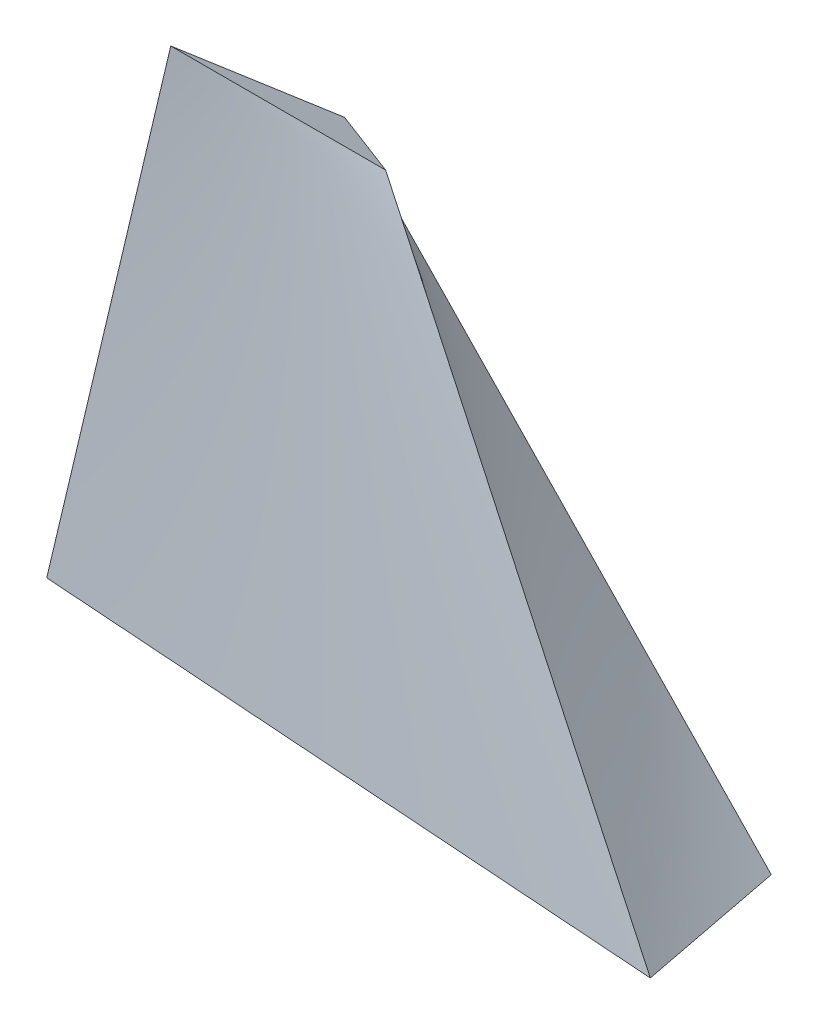
ISO-10303-21;
HEADER;
FILE_DESCRIPTION(('STEP AP214'),'2;1');
FILE_NAME('part.step','',(''),(''),'','','');
FILE_SCHEMA(('AUTOMOTIVE_DESIGN { 1 0 10303 214 1 1 1 1 }'));
ENDSEC;
DATA;
#1=APPLICATION_CONTEXT('core data for automotive mechanical design processes');
#2=APPLICATION_PROTOCOL_DEFINITION('international standard','automotive_design',2000,#1);
#3=PRODUCT_CONTEXT('',#1,'mechanical');
#4=PRODUCT('Part','Part','',(#3));
#5=PRODUCT_RELATED_PRODUCT_CATEGORY('part','',(#4));
#6=PRODUCT_DEFINITION_FORMATION('','',#4);
#7=PRODUCT_DEFINITION_CONTEXT('part definition',#1,'design');
#8=PRODUCT_DEFINITION('design','',#6,#7);
#9=PRODUCT_DEFINITION_SHAPE('','',#8);
#10=(LENGTH_UNIT() NAMED_UNIT(*) SI_UNIT(.MILLI.,.METRE.));
#11=(NAMED_UNIT(*) PLANE_ANGLE_UNIT() SI_UNIT($,.RADIAN.));
#12=(NAMED_UNIT(*) SI_UNIT($,.STERADIAN.) SOLID_ANGLE_UNIT());
#13=UNCERTAINTY_MEASURE_WITH_UNIT(LENGTH_MEASURE(1.E-05),#10,'distance_accuracy_value','');
#14=(GEOMETRIC_REPRESENTATION_CONTEXT(3) GLOBAL_UNCERTAINTY_ASSIGNED_CONTEXT((#13)) GLOBAL_UNIT_ASSIGNED_CONTEXT((#10,
#11,#12)) REPRESENTATION_CONTEXT('',''));
#15=CARTESIAN_POINT('',(0.,0.,0.));
#16=DIRECTION('',(0.,0.,1.));
#17=DIRECTION('',(1.,0.,0.));
#18=AXIS2_PLACEMENT_3D('',#15,#16,#17);
#19=CARTESIAN_POINT('',(0.,0.,0.));
#20=DIRECTION('',(0.,0.,1.));
#21=DIRECTION('',(1.,0.,0.));
#22=AXIS2_PLACEMENT_3D('',#19,#20,#21);
#23=PLANE('',#22);
#24=CARTESIAN_POINT('',(50.2624939835844,5.28695458593054,0.));
#25=CARTESIAN_POINT('',(38.1505616594526,17.8474769961413,0.));
#26=CARTESIAN_POINT('',(26.0386293353209,30.407999406352,0.));
#27=CARTESIAN_POINT('',(13.9266970111891,42.9685218165628,0.));
#28=B_SPLINE_CURVE_WITH_KNOTS('',3,(#24,#25,#26,#27),.UNSPECIFIED.,.F.,.F.,(4,4),(0.,1.),.UNSPECIFIED.);
#29=CARTESIAN_POINT('',(50.2624939835844,5.28695458593054,0.));
#30=VERTEX_POINT('',#29);
#31=CARTESIAN_POINT('',(13.9266970111891,42.9685218165628,0.));
#32=VERTEX_POINT('',#31);
#33=EDGE_CURVE('E156',#30,#32,#28,.T.);
#34=ORIENTED_EDGE('',*,*,#33,.F.);
#35=CARTESIAN_POINT('',(50.2624939835844,5.28695458593054,0.));
#36=CARTESIAN_POINT('',(33.5083293223896,3.52463639062036,0.));
#37=CARTESIAN_POINT('',(16.7541646611948,1.76231819531018,0.));
#38=CARTESIAN_POINT('',(0.,0.,0.));
#39=B_SPLINE_CURVE_WITH_KNOTS('',3,(#35,#36,#37,#38),.UNSPECIFIED.,.F.,.F.,(4,4),(0.,1.),.UNSPECIFIED.);
#40=CARTESIAN_POINT('',(0.,0.,0.));
#41=VERTEX_POINT('',#40);
#42=EDGE_CURVE('E184',#41,#30,#39,.F.);
#43=ORIENTED_EDGE('',*,*,#42,.F.);
#44=CARTESIAN_POINT('',(13.9266970111891,42.9685218165628,0.));
#45=CARTESIAN_POINT('',(9.28446467412604,28.6456812110418,0.));
#46=CARTESIAN_POINT('',(4.64223233706302,14.3228406055209,0.));
#47=CARTESIAN_POINT('',(0.,0.,0.));
#48=B_SPLINE_CURVE_WITH_KNOTS('',3,(#44,#45,#46,#47),.UNSPECIFIED.,.F.,.F.,(4,4),(0.,1.),.UNSPECIFIED.);
#49=EDGE_CURVE('E179',#41,#32,#48,.F.);
#50=ORIENTED_EDGE('',*,*,#49,.T.);
#51=EDGE_LOOP('',(#34,#43,#50));
#52=FACE_BOUND('',#51,.T.);
#53=ADVANCED_FACE('F125',(#52),#23,.F.);
#54=CARTESIAN_POINT('',(50.2624939835844,5.28695458593054,0.));
#55=CARTESIAN_POINT('',(51.0869709980779,5.28695458593054,4.25751721394363));
#56=CARTESIAN_POINT('',(51.9114480125714,5.28695458593054,8.51503442788725));
#57=CARTESIAN_POINT('',(52.7359250270649,5.28695458593054,12.7725516418309));
#58=CARTESIAN_POINT('',(38.1505616594526,17.8474769961413,0.));
#59=CARTESIAN_POINT('',(39.5537853503355,18.0743276356,3.30317043218727));
#60=CARTESIAN_POINT('',(40.9570090412184,18.3011782750587,6.60634086437454));
#61=CARTESIAN_POINT('',(42.3602327321013,18.5280289145174,9.90951129656181));
#62=CARTESIAN_POINT('',(26.0386293353209,30.407999406352,0.));
#63=CARTESIAN_POINT('',(28.0205997025931,30.8617006852695,2.34882365043091));
#64=CARTESIAN_POINT('',(30.0025700698654,31.3154019641869,4.69764730086183));
#65=CARTESIAN_POINT('',(31.9845404371377,31.7691032431043,7.04647095129274));
#66=CARTESIAN_POINT('',(13.9266970111891,42.9685218165628,0.));
#67=CARTESIAN_POINT('',(16.4874140548507,43.6490737349389,1.39447686867456));
#68=CARTESIAN_POINT('',(19.0481310985124,44.3296256533151,2.78895373734911));
#69=CARTESIAN_POINT('',(21.608848142174,45.0101775716912,4.18343060602367));
#70=B_SPLINE_SURFACE_WITH_KNOTS('',3,3,((#54,#55,#56,#57),(#58,#59,#60,#61),(#62,#63,#64,#65),
(#66,#67,#68,#69)),.UNSPECIFIED.,.F.,.F.,.F.,(4,4),(4,4),(0.,1.),(0.,1.),.UNSPECIFIED.);
#71=DIRECTION('',(-0.855237480442304,-0.227293175332603,-0.465732395796043));
#72=VECTOR('',#71,1.);
#73=CARTESIAN_POINT('',(21.608848142174,45.0101775716912,4.18343060602367));
#74=LINE('',#73,#72);
#75=CARTESIAN_POINT('',(21.608848142174,45.0101775716912,4.18343060602367));
#76=VERTEX_POINT('',#75);
#77=EDGE_CURVE('E159',#76,#32,#74,.T.);
#78=CARTESIAN_POINT('',(52.7359250270649,5.28695458593054,12.7725516418309));
#79=CARTESIAN_POINT('',(42.3602327321013,18.5280289145174,9.90951129656181));
#80=CARTESIAN_POINT('',(31.9845404371377,31.7691032431043,7.04647095129274));
#81=CARTESIAN_POINT('',(21.608848142174,45.0101775716912,4.18343060602367));
#82=B_SPLINE_CURVE_WITH_KNOTS('',3,(#78,#79,#80,#81),.UNSPECIFIED.,.F.,.F.,(4,4),(0.,1.),.UNSPECIFIED.);
#83=CARTESIAN_POINT('',(52.7359250270649,5.28695458593054,12.7725516418309));
#84=VERTEX_POINT('',#83);
#85=EDGE_CURVE('E143',#76,#84,#82,.F.);
#86=CARTESIAN_POINT('',(52.7359250270649,5.28695458593054,12.7725516418309));
#87=CARTESIAN_POINT('',(51.9114480125714,5.28695458593054,8.51503442788726));
#88=CARTESIAN_POINT('',(51.0869709980779,5.28695458593054,4.25751721394363));
#89=CARTESIAN_POINT('',(50.2624939835844,5.28695458593054,0.));
#90=B_SPLINE_CURVE_WITH_KNOTS('',3,(#86,#87,#88,#89),.UNSPECIFIED.,.F.,.F.,(4,4),(0.,1.),.UNSPECIFIED.);
#91=EDGE_CURVE('E162',#30,#84,#90,.F.);
#92=ORIENTED_EDGE('',*,*,#33,.T.);
#93=ORIENTED_EDGE('',*,*,#77,.F.);
#94=ORIENTED_EDGE('',*,*,#85,.T.);
#95=ORIENTED_EDGE('',*,*,#91,.F.);
#96=EDGE_LOOP('',(#92,#93,#94,#95));
#97=FACE_BOUND('',#96,.T.);
#98=ADVANCED_FACE('F158',(#97),#70,.T.);
#99=CARTESIAN_POINT('',(0.,34.7030516548671,-16.9362639910073));
#100=DIRECTION('',(0.,0.898687345867324,-0.438589847554574));
#101=DIRECTION('',(0.,0.438589847554574,0.898687345867324));
#102=AXIS2_PLACEMENT_3D('',#99,#100,#101);
#103=PLANE('',#102);
#104=CARTESIAN_POINT('',(3.31303219358496,45.0101775716912,4.18343060602367));
#105=CARTESIAN_POINT('',(6.85092046611966,44.329625653315,2.78895373734911));
#106=CARTESIAN_POINT('',(10.3888087386544,43.6490737349389,1.39447686867456));
#107=CARTESIAN_POINT('',(13.9266970111891,42.9685218165628,0.));
#108=B_SPLINE_CURVE_WITH_KNOTS('',3,(#104,#105,#106,#107),.UNSPECIFIED.,.F.,.F.,(4,4),(0.,1.),.UNSPECIFIED.);
#109=CARTESIAN_POINT('',(3.31303219358496,45.0101775716912,4.18343060602367));
#110=VERTEX_POINT('',#109);
#111=EDGE_CURVE('E172',#32,#110,#108,.F.);
#112=ORIENTED_EDGE('',*,*,#111,.T.);
#113=CARTESIAN_POINT('',(21.608848142174,45.0101775716912,4.18343060602367));
#114=CARTESIAN_POINT('',(15.5102428259777,45.0101775716912,4.18343060602367));
#115=CARTESIAN_POINT('',(9.41163750978132,45.0101775716912,4.18343060602367));
#116=CARTESIAN_POINT('',(3.31303219358496,45.0101775716912,4.18343060602367));
#117=B_SPLINE_CURVE_WITH_KNOTS('',3,(#113,#114,#115,#116),.UNSPECIFIED.,.F.,.F.,(4,4),(0.,1.),.UNSPECIFIED.);
#118=EDGE_CURVE('E174',#110,#76,#117,.F.);
#119=ORIENTED_EDGE('',*,*,#118,.T.);
#120=ORIENTED_EDGE('',*,*,#77,.T.);
#121=EDGE_LOOP('',(#112,#119,#120));
#122=FACE_BOUND('',#121,.T.);
#123=ADVANCED_FACE('F171',(#122),#103,.T.);
#124=CARTESIAN_POINT('',(3.31303219358496,45.0101775716912,4.18343060602367));
#125=CARTESIAN_POINT('',(6.85092046611966,44.329625653315,2.78895373734911));
#126=CARTESIAN_POINT('',(10.3888087386544,43.6490737349389,1.39447686867456));
#127=CARTESIAN_POINT('',(13.9266970111891,42.9685218165628,0.));
#128=CARTESIAN_POINT('',(-0.376773512935438,30.0067850477941,4.01397919598709));
#129=CARTESIAN_POINT('',(2.84363921608506,29.5530837688767,2.67598613065806));
#130=CARTESIAN_POINT('',(6.06405194510555,29.0993824899593,1.33799306532903));
#131=CARTESIAN_POINT('',(9.28446467412604,28.6456812110418,0.));
#132=CARTESIAN_POINT('',(-4.06657921945583,15.0033925238971,3.8445277859505));
#133=CARTESIAN_POINT('',(-1.16364203394955,14.7765418844383,2.563018523967));
#134=CARTESIAN_POINT('',(1.73929515155673,14.5496912449796,1.2815092619835));
#135=CARTESIAN_POINT('',(4.64223233706302,14.3228406055209,0.));
#136=CARTESIAN_POINT('',(-7.75638492597622,0.,3.67507637591392));
#137=CARTESIAN_POINT('',(-5.17092328398415,0.,2.45005091727595));
#138=CARTESIAN_POINT('',(-2.58546164199208,0.,1.22502545863797));
#139=CARTESIAN_POINT('',(0.,0.,0.));
#140=B_SPLINE_SURFACE_WITH_KNOTS('',3,3,((#124,#125,#126,#127),(#128,#129,#130,#131),(#132,#133,
#134,#135),(#136,#137,#138,#139)),.UNSPECIFIED.,.F.,.F.,.F.,(4,4),(4,4),(0.,1.),(0.,1.),.UNSPECIFIED.);
#141=CARTESIAN_POINT('',(-7.75638492597622,0.,3.67507637591392));
#142=CARTESIAN_POINT('',(-4.06657921945583,15.0033925238971,3.8445277859505));
#143=CARTESIAN_POINT('',(-0.376773512935437,30.0067850477941,4.01397919598709));
#144=CARTESIAN_POINT('',(3.31303219358496,45.0101775716912,4.18343060602367));
#145=B_SPLINE_CURVE_WITH_KNOTS('',3,(#141,#142,#143,#144),.UNSPECIFIED.,.F.,.F.,(4,4),(0.,1.),.UNSPECIFIED.);
#146=CARTESIAN_POINT('',(-7.75638492597622,0.,3.67507637591392));
#147=VERTEX_POINT('',#146);
#148=EDGE_CURVE('E134',#147,#110,#145,.T.);
#149=DIRECTION('',(0.903692790230263,0.,-0.428181434541295));
#150=VECTOR('',#149,1.);
#151=CARTESIAN_POINT('',(-3.87819246298811,0.,1.83753818795696));
#152=LINE('',#151,#150);
#153=EDGE_CURVE('E201',#147,#41,#152,.T.);
#154=ORIENTED_EDGE('',*,*,#148,.T.);
#155=ORIENTED_EDGE('',*,*,#111,.F.);
#156=ORIENTED_EDGE('',*,*,#49,.F.);
#157=ORIENTED_EDGE('',*,*,#153,.F.);
#158=EDGE_LOOP('',(#154,#155,#156,#157));
#159=FACE_BOUND('',#158,.T.);
#160=ADVANCED_FACE('F177',(#159),#140,.F.);
#161=CARTESIAN_POINT('',(52.7359250270649,5.28695458593054,12.7725516418309));
#162=CARTESIAN_POINT('',(51.9114480125714,5.28695458593054,8.51503442788726));
#163=CARTESIAN_POINT('',(51.0869709980779,5.28695458593054,4.25751721394363));
#164=CARTESIAN_POINT('',(50.2624939835844,5.28695458593054,0.));
#165=CARTESIAN_POINT('',(32.5718217093845,3.52463639062036,9.74005988652523));
#166=CARTESIAN_POINT('',(32.8839909137196,3.52463639062036,6.49337325768349));
#167=CARTESIAN_POINT('',(33.1961601180546,3.52463639062036,3.24668662884174));
#168=CARTESIAN_POINT('',(33.5083293223896,3.52463639062036,0.));
#169=CARTESIAN_POINT('',(12.4077183917042,1.76231819531018,6.70756813121957));
#170=CARTESIAN_POINT('',(13.8565338148677,1.76231819531018,4.47171208747972));
#171=CARTESIAN_POINT('',(15.3053492380313,1.76231819531018,2.23585604373986));
#172=CARTESIAN_POINT('',(16.7541646611948,1.76231819531018,0.));
#173=CARTESIAN_POINT('',(-7.75638492597622,0.,3.67507637591392));
#174=CARTESIAN_POINT('',(-5.17092328398415,0.,2.45005091727595));
#175=CARTESIAN_POINT('',(-2.58546164199207,0.,1.22502545863797));
#176=CARTESIAN_POINT('',(0.,0.,0.));
#177=B_SPLINE_SURFACE_WITH_KNOTS('',3,3,((#161,#162,#163,#164),(#165,#166,#167,#168),(#169,#170,
#171,#172),(#173,#174,#175,#176)),.UNSPECIFIED.,.F.,.F.,.F.,(4,4),(4,4),(0.,1.),(0.,1.),.UNSPECIFIED.);
#178=CARTESIAN_POINT('',(52.7359250270649,5.28695458593054,12.7725516418309));
#179=CARTESIAN_POINT('',(32.5718217093845,3.52463639062036,9.74005988652523));
#180=CARTESIAN_POINT('',(12.4077183917042,1.76231819531018,6.70756813121957));
#181=CARTESIAN_POINT('',(-7.75638492597622,0.,3.67507637591392));
#182=B_SPLINE_CURVE_WITH_KNOTS('',3,(#178,#179,#180,#181),.UNSPECIFIED.,.F.,.F.,(4,4),(0.,1.),.UNSPECIFIED.);
#183=EDGE_CURVE('E13',#84,#147,#182,.T.);
#184=ORIENTED_EDGE('',*,*,#183,.T.);
#185=ORIENTED_EDGE('',*,*,#153,.T.);
#186=ORIENTED_EDGE('',*,*,#42,.T.);
#187=ORIENTED_EDGE('',*,*,#91,.T.);
#188=EDGE_LOOP('',(#184,#185,#186,#187));
#189=FACE_BOUND('',#188,.T.);
#190=ADVANCED_FACE('F264',(#189),#177,.T.);
#191=CARTESIAN_POINT('',(52.7359250270649,5.28695458593054,12.7725516418309));
#192=CARTESIAN_POINT('',(42.3602327321013,18.5280289145174,9.90951129656181));
#193=CARTESIAN_POINT('',(31.9845404371377,31.7691032431043,7.04647095129274));
#194=CARTESIAN_POINT('',(21.608848142174,45.0101775716912,4.18343060602367));
#195=CARTESIAN_POINT('',(32.5718217093845,3.52463639062036,9.74005988652523));
#196=CARTESIAN_POINT('',(26.8846287482489,17.353150117644,7.88785012635804));
#197=CARTESIAN_POINT('',(21.1974357871133,31.1816638446676,6.03564036619086));
#198=CARTESIAN_POINT('',(15.5102428259777,45.0101775716912,4.18343060602367));
#199=CARTESIAN_POINT('',(12.4077183917042,1.76231819531018,6.70756813121957));
#200=CARTESIAN_POINT('',(11.4090247643965,16.1782713207705,5.86618895615427));
#201=CARTESIAN_POINT('',(10.4103311370889,30.5942244462308,5.02480978108897));
#202=CARTESIAN_POINT('',(9.41163750978132,45.0101775716912,4.18343060602367));
#203=CARTESIAN_POINT('',(-7.75638492597622,0.,3.67507637591392));
#204=CARTESIAN_POINT('',(-4.06657921945583,15.0033925238971,3.8445277859505));
#205=CARTESIAN_POINT('',(-0.376773512935437,30.0067850477941,4.01397919598709));
#206=CARTESIAN_POINT('',(3.31303219358496,45.0101775716912,4.18343060602367));
#207=B_SPLINE_SURFACE_WITH_KNOTS('',3,3,((#191,#192,#193,#194),(#195,#196,#197,#198),(#199,#200,
#201,#202),(#203,#204,#205,#206)),.UNSPECIFIED.,.F.,.F.,.F.,(4,4),(4,4),(0.,1.),(0.,1.),.UNSPECIFIED.);
#208=ORIENTED_EDGE('',*,*,#183,.F.);
#209=ORIENTED_EDGE('',*,*,#85,.F.);
#210=ORIENTED_EDGE('',*,*,#118,.F.);
#211=ORIENTED_EDGE('',*,*,#148,.F.);
#212=EDGE_LOOP('',(#208,#209,#210,#211));
#213=FACE_BOUND('',#212,.T.);
#214=ADVANCED_FACE('F267',(#213),#207,.F.);
#215=CLOSED_SHELL('',(#53,#98,#123,#160,#190,#214));
#216=MANIFOLD_SOLID_BREP('B2',#215);
#217=ADVANCED_BREP_SHAPE_REPRESENTATION('',(#18,#216),#14);
#218=SHAPE_DEFINITION_REPRESENTATION(#9,#217);
ENDSEC;
END-ISO-10303-21;
